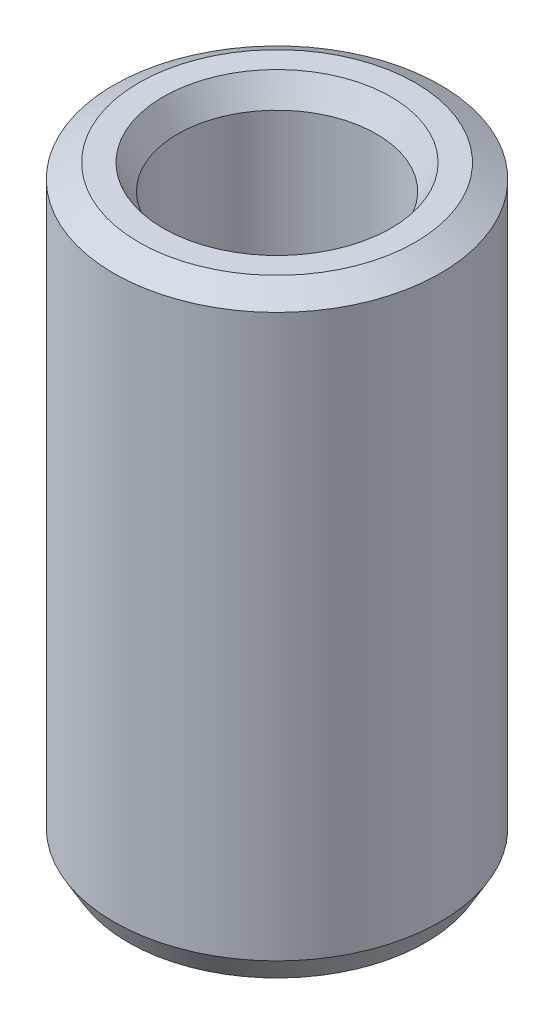
ISO-10303-21;
HEADER;
FILE_DESCRIPTION(('STEP AP214'),'2;1');
FILE_NAME('part.step','',(''),(''),'','','');
FILE_SCHEMA(('AUTOMOTIVE_DESIGN { 1 0 10303 214 1 1 1 1 }'));
ENDSEC;
DATA;
#1=APPLICATION_CONTEXT('core data for automotive mechanical design processes');
#2=APPLICATION_PROTOCOL_DEFINITION('international standard','automotive_design',2000,#1);
#3=PRODUCT_CONTEXT('',#1,'mechanical');
#4=PRODUCT('Part','Part','',(#3));
#5=PRODUCT_RELATED_PRODUCT_CATEGORY('part','',(#4));
#6=PRODUCT_DEFINITION_FORMATION('','',#4);
#7=PRODUCT_DEFINITION_CONTEXT('part definition',#1,'design');
#8=PRODUCT_DEFINITION('design','',#6,#7);
#9=PRODUCT_DEFINITION_SHAPE('','',#8);
#10=(LENGTH_UNIT() NAMED_UNIT(*) SI_UNIT(.MILLI.,.METRE.));
#11=(NAMED_UNIT(*) PLANE_ANGLE_UNIT() SI_UNIT($,.RADIAN.));
#12=(NAMED_UNIT(*) SI_UNIT($,.STERADIAN.) SOLID_ANGLE_UNIT());
#13=UNCERTAINTY_MEASURE_WITH_UNIT(LENGTH_MEASURE(1.E-05),#10,'distance_accuracy_value','');
#14=(GEOMETRIC_REPRESENTATION_CONTEXT(3) GLOBAL_UNCERTAINTY_ASSIGNED_CONTEXT((#13)) GLOBAL_UNIT_ASSIGNED_CONTEXT((#10,
#11,#12)) REPRESENTATION_CONTEXT('',''));
#15=CARTESIAN_POINT('',(0.,0.,0.));
#16=DIRECTION('',(0.,0.,1.));
#17=DIRECTION('',(1.,0.,0.));
#18=AXIS2_PLACEMENT_3D('',#15,#16,#17);
#19=CARTESIAN_POINT('',(0.,36.8282559131511,0.));
#20=DIRECTION('',(0.,-1.,0.));
#21=DIRECTION('',(0.,0.,-1.));
#22=AXIS2_PLACEMENT_3D('',#19,#20,#21);
#23=CYLINDRICAL_SURFACE('',#22,10.);
#24=CARTESIAN_POINT('',(0.,1.53196302603668,0.));
#25=DIRECTION('',(0.,1.,0.));
#26=DIRECTION('',(0.,0.,1.));
#27=AXIS2_PLACEMENT_3D('',#24,#25,#26);
#28=CIRCLE('',#27,10.);
#29=CARTESIAN_POINT('',(0.,1.53196302603668,10.));
#30=VERTEX_POINT('',#29);
#31=EDGE_CURVE('E10',#30,#30,#28,.T.);
#32=ORIENTED_EDGE('',*,*,#31,.T.);
#33=EDGE_LOOP('',(#32));
#34=FACE_BOUND('',#33,.T.);
#35=CARTESIAN_POINT('',(0.,35.9437766476803,0.));
#36=DIRECTION('',(0.,1.,0.));
#37=DIRECTION('',(0.,0.,1.));
#38=AXIS2_PLACEMENT_3D('',#35,#36,#37);
#39=CIRCLE('',#38,10.);
#40=CARTESIAN_POINT('',(0.,35.9437766476803,10.));
#41=VERTEX_POINT('',#40);
#42=EDGE_CURVE('E50',#41,#41,#39,.F.);
#43=ORIENTED_EDGE('',*,*,#42,.T.);
#44=EDGE_LOOP('',(#43));
#45=FACE_BOUND('',#44,.T.);
#46=ADVANCED_FACE('F39',(#34,#45),#23,.T.);
#47=CARTESIAN_POINT('',(0.,36.8282559131511,0.));
#48=DIRECTION('',(0.,1.,0.));
#49=DIRECTION('',(0.,0.,1.));
#50=AXIS2_PLACEMENT_3D('',#47,#48,#49);
#51=PLANE('',#50);
#52=CARTESIAN_POINT('',(0.,36.8282559131511,0.));
#53=DIRECTION('',(0.,1.,0.));
#54=DIRECTION('',(0.,0.,1.));
#55=AXIS2_PLACEMENT_3D('',#52,#53,#54);
#56=CIRCLE('',#55,6.97974527566179);
#57=CARTESIAN_POINT('',(0.,36.8282559131511,6.97974527566179));
#58=VERTEX_POINT('',#57);
#59=EDGE_CURVE('E58',#58,#58,#56,.F.);
#60=ORIENTED_EDGE('',*,*,#59,.T.);
#61=EDGE_LOOP('',(#60));
#62=FACE_BOUND('',#61,.T.);
#63=CARTESIAN_POINT('',(0.,36.8282559131511,0.));
#64=DIRECTION('',(0.,1.,0.));
#65=DIRECTION('',(0.,0.,1.));
#66=AXIS2_PLACEMENT_3D('',#63,#64,#65);
#67=CIRCLE('',#66,8.46803697396332);
#68=CARTESIAN_POINT('',(0.,36.8282559131511,8.46803697396332));
#69=VERTEX_POINT('',#68);
#70=EDGE_CURVE('E61',#69,#69,#67,.T.);
#71=ORIENTED_EDGE('',*,*,#70,.T.);
#72=EDGE_LOOP('',(#71));
#73=FACE_BOUND('',#72,.T.);
#74=ADVANCED_FACE('F88',(#62,#73),#51,.T.);
#75=CARTESIAN_POINT('',(0.,0.,0.));
#76=DIRECTION('',(0.,1.,0.));
#77=DIRECTION('',(0.,0.,1.));
#78=AXIS2_PLACEMENT_3D('',#75,#76,#77);
#79=PLANE('',#78);
#80=CARTESIAN_POINT('',(0.,0.,0.));
#81=DIRECTION('',(0.,1.,0.));
#82=DIRECTION('',(0.,0.,1.));
#83=AXIS2_PLACEMENT_3D('',#80,#81,#82);
#84=CIRCLE('',#83,7.62722903622764);
#85=CARTESIAN_POINT('',(0.,0.,7.62722903622764));
#86=VERTEX_POINT('',#85);
#87=EDGE_CURVE('E51',#86,#86,#84,.T.);
#88=ORIENTED_EDGE('',*,*,#87,.T.);
#89=EDGE_LOOP('',(#88));
#90=FACE_BOUND('',#89,.T.);
#91=CARTESIAN_POINT('',(0.,0.,0.));
#92=DIRECTION('',(0.,1.,0.));
#93=DIRECTION('',(0.,0.,1.));
#94=AXIS2_PLACEMENT_3D('',#91,#92,#93);
#95=CIRCLE('',#94,9.11552073452916);
#96=CARTESIAN_POINT('',(0.,0.,9.11552073452916));
#97=VERTEX_POINT('',#96);
#98=EDGE_CURVE('E54',#97,#97,#95,.F.);
#99=ORIENTED_EDGE('',*,*,#98,.T.);
#100=EDGE_LOOP('',(#99));
#101=FACE_BOUND('',#100,.T.);
#102=ADVANCED_FACE('F83',(#90,#101),#79,.F.);
#103=CARTESIAN_POINT('',(0.,36.8282559131511,0.));
#104=DIRECTION('',(0.,-1.,0.));
#105=DIRECTION('',(0.,0.,-1.));
#106=AXIS2_PLACEMENT_3D('',#103,#104,#105);
#107=CYLINDRICAL_SURFACE('',#106,6.09526601019095);
#108=CARTESIAN_POINT('',(0.,35.2962928871144,0.));
#109=DIRECTION('',(0.,1.,0.));
#110=DIRECTION('',(0.,0.,1.));
#111=AXIS2_PLACEMENT_3D('',#108,#109,#110);
#112=CIRCLE('',#111,6.09526601019095);
#113=CARTESIAN_POINT('',(0.,35.2962928871144,6.09526601019095));
#114=VERTEX_POINT('',#113);
#115=EDGE_CURVE('E67',#114,#114,#112,.T.);
#116=ORIENTED_EDGE('',*,*,#115,.T.);
#117=EDGE_LOOP('',(#116));
#118=FACE_BOUND('',#117,.T.);
#119=CARTESIAN_POINT('',(0.,0.884479265470847,0.));
#120=DIRECTION('',(0.,1.,0.));
#121=DIRECTION('',(0.,0.,1.));
#122=AXIS2_PLACEMENT_3D('',#119,#120,#121);
#123=CIRCLE('',#122,6.09526601019095);
#124=CARTESIAN_POINT('',(0.,0.884479265470847,6.09526601019095));
#125=VERTEX_POINT('',#124);
#126=EDGE_CURVE('E69',#125,#125,#123,.F.);
#127=ORIENTED_EDGE('',*,*,#126,.T.);
#128=EDGE_LOOP('',(#127));
#129=FACE_BOUND('',#128,.T.);
#130=ADVANCED_FACE('F71',(#118,#129),#107,.F.);
#131=CARTESIAN_POINT('',(0.,35.2962928871144,0.));
#132=DIRECTION('',(0.,1.,0.));
#133=DIRECTION('',(0.,0.,1.));
#134=AXIS2_PLACEMENT_3D('',#131,#132,#133);
#135=CONICAL_SURFACE('',#134,6.09526601019095,0.523598775598299);
#136=CARTESIAN_POINT('',(0.,36.8282559131511,6.97974527566179));
#137=CARTESIAN_POINT('',(0.,36.8122979649632,6.97053194997981));
#138=CARTESIAN_POINT('',(0.,36.7963400167753,6.96131862429782));
#139=CARTESIAN_POINT('',(0.,36.7644241203996,6.94289197293384));
#140=CARTESIAN_POINT('',(0.,36.7484661722117,6.93367864725185));
#141=CARTESIAN_POINT('',(0.,36.7165502758359,6.91525199588788));
#142=CARTESIAN_POINT('',(0.,36.700592327648,6.90603867020589));
#143=CARTESIAN_POINT('',(0.,36.6686764312723,6.88761201884191));
#144=CARTESIAN_POINT('',(0.,36.6527184830844,6.87839869315993));
#145=CARTESIAN_POINT('',(0.,36.6208025867086,6.85997204179595));
#146=CARTESIAN_POINT('',(0.,36.6048446385208,6.85075871611396));
#147=CARTESIAN_POINT('',(0.,36.572928742145,6.83233206474999));
#148=CARTESIAN_POINT('',(0.,36.5569707939571,6.823118739068));
#149=CARTESIAN_POINT('',(0.,36.5250548975813,6.80469208770402));
#150=CARTESIAN_POINT('',(0.,36.5090969493935,6.79547876202203));
#151=CARTESIAN_POINT('',(0.,36.4771810530177,6.77705211065806));
#152=CARTESIAN_POINT('',(0.,36.4612231048298,6.76783878497607));
#153=CARTESIAN_POINT('',(0.,36.429307208454,6.74941213361209));
#154=CARTESIAN_POINT('',(0.,36.4133492602662,6.74019880793011));
#155=CARTESIAN_POINT('',(0.,36.3814333638904,6.72177215656613));
#156=CARTESIAN_POINT('',(0.,36.3654754157025,6.71255883088414));
#157=CARTESIAN_POINT('',(0.,36.3335595193268,6.69413217952017));
#158=CARTESIAN_POINT('',(0.,36.3176015711389,6.68491885383818));
#159=CARTESIAN_POINT('',(0.,36.2856856747631,6.6664922024742));
#160=CARTESIAN_POINT('',(0.,36.2697277265752,6.65727887679221));
#161=CARTESIAN_POINT('',(0.,36.2378118301995,6.63885222542824));
#162=CARTESIAN_POINT('',(0.,36.2218538820116,6.62963889974625));
#163=CARTESIAN_POINT('',(0.,36.1899379856358,6.61121224838228));
#164=CARTESIAN_POINT('',(0.,36.1739800374479,6.60199892270029));
#165=CARTESIAN_POINT('',(0.,36.1420641410722,6.58357227133631));
#166=CARTESIAN_POINT('',(0.,36.1261061928843,6.57435894565432));
#167=CARTESIAN_POINT('',(0.,36.0941902965085,6.55593229429035));
#168=CARTESIAN_POINT('',(0.,36.0782323483206,6.54671896860836));
#169=CARTESIAN_POINT('',(0.,36.0463164519449,6.52829231724438));
#170=CARTESIAN_POINT('',(0.,36.030358503757,6.5190789915624));
#171=CARTESIAN_POINT('',(0.,35.9984426073812,6.50065234019842));
#172=CARTESIAN_POINT('',(0.,35.9824846591933,6.49143901451643));
#173=CARTESIAN_POINT('',(0.,35.9505687628176,6.47301236315246));
#174=CARTESIAN_POINT('',(0.,35.9346108146297,6.46379903747047));
#175=CARTESIAN_POINT('',(0.,35.9026949182539,6.44537238610649));
#176=CARTESIAN_POINT('',(0.,35.8867369700661,6.4361590604245));
#177=CARTESIAN_POINT('',(0.,35.8548210736903,6.41773240906053));
#178=CARTESIAN_POINT('',(0.,35.8388631255024,6.40851908337854));
#179=CARTESIAN_POINT('',(0.,35.8069472291266,6.39009243201456));
#180=CARTESIAN_POINT('',(0.,35.7909892809388,6.38087910633258));
#181=CARTESIAN_POINT('',(0.,35.759073384563,6.3624524549686));
#182=CARTESIAN_POINT('',(0.,35.7431154363751,6.35323912928661));
#183=CARTESIAN_POINT('',(0.,35.7111995399993,6.33481247792264));
#184=CARTESIAN_POINT('',(0.,35.6952415918115,6.32559915224065));
#185=CARTESIAN_POINT('',(0.,35.6633256954357,6.30717250087667));
#186=CARTESIAN_POINT('',(0.,35.6473677472478,6.29795917519469));
#187=CARTESIAN_POINT('',(0.,35.6154518508721,6.27953252383071));
#188=CARTESIAN_POINT('',(0.,35.5994939026842,6.27031919814872));
#189=CARTESIAN_POINT('',(0.,35.5675780063084,6.25189254678475));
#190=CARTESIAN_POINT('',(0.,35.5516200581205,6.24267922110276));
#191=CARTESIAN_POINT('',(0.,35.5197041617448,6.22425256973878));
#192=CARTESIAN_POINT('',(0.,35.5037462135569,6.21503924405679));
#193=CARTESIAN_POINT('',(0.,35.4718303171811,6.19661259269282));
#194=CARTESIAN_POINT('',(0.,35.4558723689932,6.18739926701083));
#195=CARTESIAN_POINT('',(0.,35.4239564726175,6.16897261564685));
#196=CARTESIAN_POINT('',(0.,35.4079985244296,6.15975928996487));
#197=CARTESIAN_POINT('',(0.,35.3760826280538,6.14133263860089));
#198=CARTESIAN_POINT('',(0.,35.3601246798659,6.1321193129189));
#199=CARTESIAN_POINT('',(0.,35.3282087834902,6.11369266155493));
#200=CARTESIAN_POINT('',(0.,35.3122508353023,6.10447933587294));
#201=CARTESIAN_POINT('',(0.,35.2962928871144,6.09526601019095));
#202=B_SPLINE_CURVE_WITH_KNOTS('',3,(#136,#137,#138,#139,#140,#141,#142,#143,#144,#145,#146,
#147,#148,#149,#150,#151,#152,#153,#154,#155,#156,#157,#158,#159,#160,#161,#162,#163,#164,#165,
#166,#167,#168,#169,#170,#171,#172,#173,#174,#175,#176,#177,#178,#179,#180,#181,#182,#183,#184,
#185,#186,#187,#188,#189,#190,#191,#192,#193,#194,#195,#196,#197,#198,#199,#200,#201),
.UNSPECIFIED.,.F.,.F.,(4,2,2,2,2,2,2,2,2,2,2,2,2,2,2,2,2,2,2,2,2,2,2,2,2,2,2,2,2,2,2,2,4),(0.,
0.055279954091932,0.110559908183858,0.165839862275784,0.22111981636771,0.276399770459643,
0.331679724551569,0.386959678643495,0.44223963273542,0.497519586827353,0.552799540919279,
0.608079495011205,0.663359449103131,0.718639403195063,0.773919357286989,0.829199311378916,
0.884479265470842,0.939759219562774,0.9950391736547,1.05031912774663,1.10559908183855,
1.16087903593048,1.21615899002241,1.27143894411434,1.32671889820627,1.38199885229819,
1.43727880639012,1.49255876048205,1.54783871457398,1.60311866866591,1.65839862275783,
1.71367857684976,1.76895853094168),.UNSPECIFIED.);
#203=EDGE_CURVE('BSEAM77',#58,#114,#202,.T.);
#204=ORIENTED_EDGE('',*,*,#59,.F.);
#205=ORIENTED_EDGE('',*,*,#115,.F.);
#206=ORIENTED_EDGE('',*,*,#203,.T.);
#207=ORIENTED_EDGE('',*,*,#203,.F.);
#208=EDGE_LOOP('',(#204,#206,#205,#207));
#209=FACE_BOUND('',#208,.T.);
#210=ADVANCED_FACE('F77',(#209),#135,.F.);
#211=CARTESIAN_POINT('',(0.,0.,0.));
#212=DIRECTION('',(0.,-1.,0.));
#213=DIRECTION('',(0.,0.,-1.));
#214=AXIS2_PLACEMENT_3D('',#211,#212,#213);
#215=CONICAL_SURFACE('',#214,7.62722903622764,1.04719755119659);
#216=ORIENTED_EDGE('',*,*,#126,.F.);
#217=EDGE_LOOP('',(#216));
#218=FACE_BOUND('',#217,.T.);
#219=ORIENTED_EDGE('',*,*,#87,.F.);
#220=EDGE_LOOP('',(#219));
#221=FACE_BOUND('',#220,.T.);
#222=ADVANCED_FACE('F73',(#218,#221),#215,.F.);
#223=CARTESIAN_POINT('',(0.,1.53196302603668,0.));
#224=DIRECTION('',(0.,1.,0.));
#225=DIRECTION('',(0.,0.,1.));
#226=AXIS2_PLACEMENT_3D('',#223,#224,#225);
#227=CONICAL_SURFACE('',#226,10.,0.523598775598302);
#228=CARTESIAN_POINT('',(0.,0.,9.11552073452916));
#229=CARTESIAN_POINT('',(0.,0.0159579481878815,9.12473406021115));
#230=CARTESIAN_POINT('',(0.,0.0319158963757638,9.13394738589314));
#231=CARTESIAN_POINT('',(0.,0.0638317927515283,9.15237403725711));
#232=CARTESIAN_POINT('',(0.,0.0797897409394106,9.1615873629391));
#233=CARTESIAN_POINT('',(0.,0.111705637315175,9.18001401430308));
#234=CARTESIAN_POINT('',(0.,0.127663585503057,9.18922733998506));
#235=CARTESIAN_POINT('',(0.,0.159579481878821,9.20765399134904));
#236=CARTESIAN_POINT('',(0.,0.175537430066703,9.21686731703103));
#237=CARTESIAN_POINT('',(0.,0.207453326442468,9.235293968395));
#238=CARTESIAN_POINT('',(0.,0.22341127463035,9.24450729407699));
#239=CARTESIAN_POINT('',(0.,0.255327171006114,9.26293394544097));
#240=CARTESIAN_POINT('',(0.,0.271285119193996,9.27214727112296));
#241=CARTESIAN_POINT('',(0.,0.30320101556976,9.29057392248693));
#242=CARTESIAN_POINT('',(0.,0.319158963757642,9.29978724816892));
#243=CARTESIAN_POINT('',(0.,0.351074860133407,9.31821389953289));
#244=CARTESIAN_POINT('',(0.,0.367032808321289,9.32742722521488));
#245=CARTESIAN_POINT('',(0.,0.398948704697053,9.34585387657886));
#246=CARTESIAN_POINT('',(0.,0.414906652884935,9.35506720226085));
#247=CARTESIAN_POINT('',(0.,0.446822549260699,9.37349385362482));
#248=CARTESIAN_POINT('',(0.,0.462780497448582,9.38270717930681));
#249=CARTESIAN_POINT('',(0.,0.494696393824345,9.40113383067079));
#250=CARTESIAN_POINT('',(0.,0.510654342012228,9.41034715635278));
#251=CARTESIAN_POINT('',(0.,0.542570238387992,9.42877380771675));
#252=CARTESIAN_POINT('',(0.,0.558528186575874,9.43798713339874));
#253=CARTESIAN_POINT('',(0.,0.590444082951639,9.45641378476271));
#254=CARTESIAN_POINT('',(0.,0.606402031139521,9.4656271104447));
#255=CARTESIAN_POINT('',(0.,0.638317927515285,9.48405376180868));
#256=CARTESIAN_POINT('',(0.,0.654275875703167,9.49326708749067));
#257=CARTESIAN_POINT('',(0.,0.686191772078931,9.51169373885464));
#258=CARTESIAN_POINT('',(0.,0.702149720266813,9.52090706453663));
#259=CARTESIAN_POINT('',(0.,0.734065616642578,9.53933371590061));
#260=CARTESIAN_POINT('',(0.,0.75002356483046,9.54854704158259));
#261=CARTESIAN_POINT('',(0.,0.781939461206224,9.56697369294657));
#262=CARTESIAN_POINT('',(0.,0.797897409394106,9.57618701862856));
#263=CARTESIAN_POINT('',(0.,0.82981330576987,9.59461366999253));
#264=CARTESIAN_POINT('',(0.,0.845771253957753,9.60382699567452));
#265=CARTESIAN_POINT('',(0.,0.877687150333517,9.6222536470385));
#266=CARTESIAN_POINT('',(0.,0.893645098521399,9.63146697272049));
#267=CARTESIAN_POINT('',(0.,0.925560994897163,9.64989362408446));
#268=CARTESIAN_POINT('',(0.,0.941518943085045,9.65910694976645));
#269=CARTESIAN_POINT('',(0.,0.97343483946081,9.67753360113042));
#270=CARTESIAN_POINT('',(0.,0.989392787648692,9.68674692681241));
#271=CARTESIAN_POINT('',(0.,1.02130868402446,9.70517357817639));
#272=CARTESIAN_POINT('',(0.,1.03726663221234,9.71438690385838));
#273=CARTESIAN_POINT('',(0.,1.0691825285881,9.73281355522235));
#274=CARTESIAN_POINT('',(0.,1.08514047677598,9.74202688090434));
#275=CARTESIAN_POINT('',(0.,1.11705637315175,9.76045353226831));
#276=CARTESIAN_POINT('',(0.,1.13301432133963,9.7696668579503));
#277=CARTESIAN_POINT('',(0.,1.16493021771539,9.78809350931428));
#278=CARTESIAN_POINT('',(0.,1.18088816590328,9.79730683499627));
#279=CARTESIAN_POINT('',(0.,1.21280406227904,9.81573348636024));
#280=CARTESIAN_POINT('',(0.,1.22876201046692,9.82494681204223));
#281=CARTESIAN_POINT('',(0.,1.26067790684269,9.84337346340621));
#282=CARTESIAN_POINT('',(0.,1.27663585503057,9.8525867890882));
#283=CARTESIAN_POINT('',(0.,1.30855175140633,9.87101344045217));
#284=CARTESIAN_POINT('',(0.,1.32450969959422,9.88022676613416));
#285=CARTESIAN_POINT('',(0.,1.35642559596998,9.89865341749813));
#286=CARTESIAN_POINT('',(0.,1.37238354415786,9.90786674318012));
#287=CARTESIAN_POINT('',(0.,1.40429944053363,9.9262933945441));
#288=CARTESIAN_POINT('',(0.,1.42025738872151,9.93550672022609));
#289=CARTESIAN_POINT('',(0.,1.45217328509727,9.95393337159006));
#290=CARTESIAN_POINT('',(0.,1.46813123328516,9.96314669727205));
#291=CARTESIAN_POINT('',(0.,1.50004712966092,9.98157334863603));
#292=CARTESIAN_POINT('',(0.,1.5160050778488,9.99078667431801));
#293=CARTESIAN_POINT('',(0.,1.53196302603668,10.));
#294=B_SPLINE_CURVE_WITH_KNOTS('',3,(#228,#229,#230,#231,#232,#233,#234,#235,#236,#237,#238,
#239,#240,#241,#242,#243,#244,#245,#246,#247,#248,#249,#250,#251,#252,#253,#254,#255,#256,#257,
#258,#259,#260,#261,#262,#263,#264,#265,#266,#267,#268,#269,#270,#271,#272,#273,#274,#275,#276,
#277,#278,#279,#280,#281,#282,#283,#284,#285,#286,#287,#288,#289,#290,#291,#292,#293),
.UNSPECIFIED.,.F.,.F.,(4,2,2,2,2,2,2,2,2,2,2,2,2,2,2,2,2,2,2,2,2,2,2,2,2,2,2,2,2,2,2,2,4),(0.,
0.0552799540919275,0.110559908183854,0.165839862275782,0.221119816367708,0.276399770459636,
0.331679724551563,0.38695967864349,0.442239632735417,0.497519586827344,0.552799540919272,
0.608079495011199,0.663359449103126,0.718639403195053,0.773919357286981,0.829199311378907,
0.884479265470835,0.939759219562762,0.995039173654689,1.05031912774662,1.10559908183854,
1.16087903593047,1.2161589900224,1.27143894411432,1.32671889820625,1.38199885229818,
1.43727880639011,1.49255876048203,1.54783871457396,1.60311866866589,1.65839862275782,
1.71367857684974,1.76895853094167),.UNSPECIFIED.);
#295=EDGE_CURVE('BSEAM76',#97,#30,#294,.T.);
#296=ORIENTED_EDGE('',*,*,#98,.F.);
#297=ORIENTED_EDGE('',*,*,#31,.F.);
#298=ORIENTED_EDGE('',*,*,#295,.T.);
#299=ORIENTED_EDGE('',*,*,#295,.F.);
#300=EDGE_LOOP('',(#296,#298,#297,#299));
#301=FACE_BOUND('',#300,.T.);
#302=ADVANCED_FACE('F76',(#301),#227,.T.);
#303=CARTESIAN_POINT('',(0.,36.8282559131511,0.));
#304=DIRECTION('',(0.,-1.,0.));
#305=DIRECTION('',(0.,0.,-1.));
#306=AXIS2_PLACEMENT_3D('',#303,#304,#305);
#307=CONICAL_SURFACE('',#306,8.46803697396332,1.04719755119659);
#308=ORIENTED_EDGE('',*,*,#42,.F.);
#309=EDGE_LOOP('',(#308));
#310=FACE_BOUND('',#309,.T.);
#311=ORIENTED_EDGE('',*,*,#70,.F.);
#312=EDGE_LOOP('',(#311));
#313=FACE_BOUND('',#312,.T.);
#314=ADVANCED_FACE('F45',(#310,#313),#307,.T.);
#315=CLOSED_SHELL('',(#46,#74,#102,#130,#210,#222,#302,#314));
#316=MANIFOLD_SOLID_BREP('B2',#315);
#317=ADVANCED_BREP_SHAPE_REPRESENTATION('',(#18,#316),#14);
#318=SHAPE_DEFINITION_REPRESENTATION(#9,#317);
ENDSEC;
END-ISO-10303-21;
